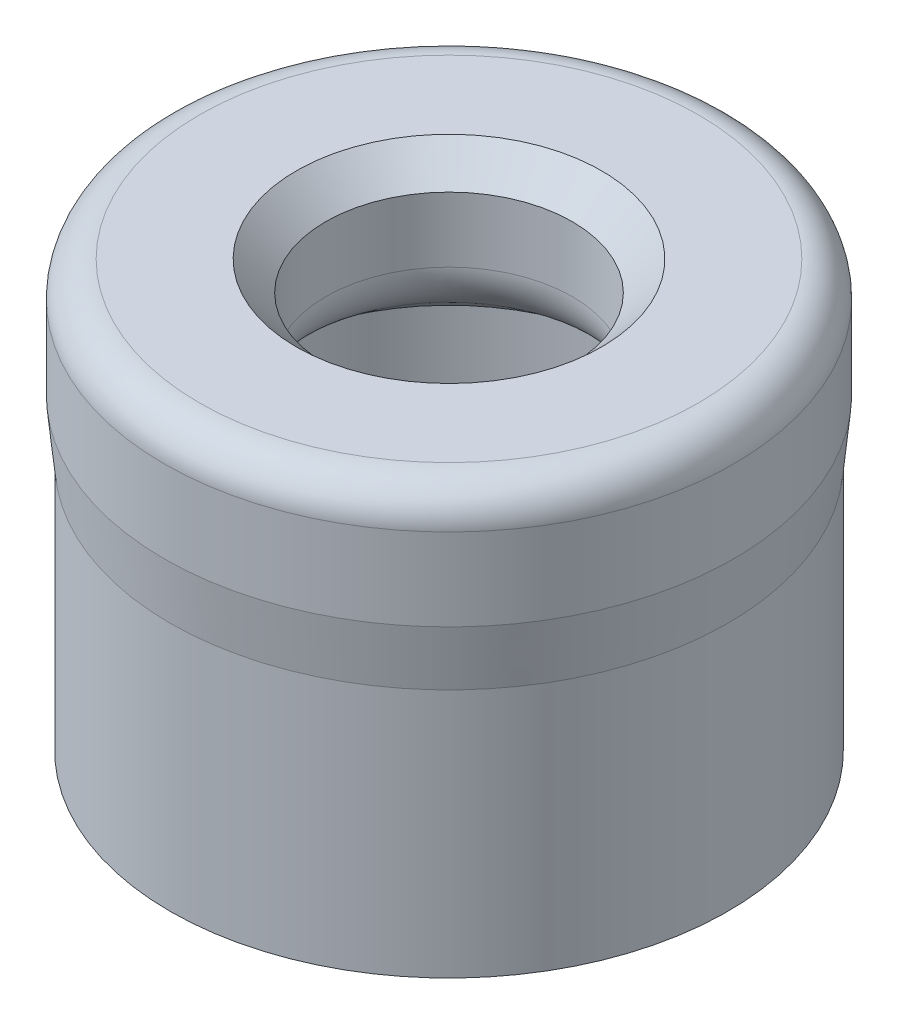
ISO-10303-21;
HEADER;
FILE_DESCRIPTION(('STEP AP214'),'2;1');
FILE_NAME('part.step','',(''),(''),'','','');
FILE_SCHEMA(('AUTOMOTIVE_DESIGN { 1 0 10303 214 1 1 1 1 }'));
ENDSEC;
DATA;
#1=APPLICATION_CONTEXT('core data for automotive mechanical design processes');
#2=APPLICATION_PROTOCOL_DEFINITION('international standard','automotive_design',2000,#1);
#3=PRODUCT_CONTEXT('',#1,'mechanical');
#4=PRODUCT('Part','Part','',(#3));
#5=PRODUCT_RELATED_PRODUCT_CATEGORY('part','',(#4));
#6=PRODUCT_DEFINITION_FORMATION('','',#4);
#7=PRODUCT_DEFINITION_CONTEXT('part definition',#1,'design');
#8=PRODUCT_DEFINITION('design','',#6,#7);
#9=PRODUCT_DEFINITION_SHAPE('','',#8);
#10=(LENGTH_UNIT() NAMED_UNIT(*) SI_UNIT(.MILLI.,.METRE.));
#11=(NAMED_UNIT(*) PLANE_ANGLE_UNIT() SI_UNIT($,.RADIAN.));
#12=(NAMED_UNIT(*) SI_UNIT($,.STERADIAN.) SOLID_ANGLE_UNIT());
#13=UNCERTAINTY_MEASURE_WITH_UNIT(LENGTH_MEASURE(1.E-05),#10,'distance_accuracy_value','');
#14=(GEOMETRIC_REPRESENTATION_CONTEXT(3) GLOBAL_UNCERTAINTY_ASSIGNED_CONTEXT((#13)) GLOBAL_UNIT_ASSIGNED_CONTEXT((#10,
#11,#12)) REPRESENTATION_CONTEXT('',''));
#15=CARTESIAN_POINT('',(0.,0.,0.));
#16=DIRECTION('',(0.,0.,1.));
#17=DIRECTION('',(1.,0.,0.));
#18=AXIS2_PLACEMENT_3D('',#15,#16,#17);
#19=CARTESIAN_POINT('',(0.,0.,0.));
#20=DIRECTION('',(0.,1.,0.));
#21=DIRECTION('',(0.,0.,1.));
#22=AXIS2_PLACEMENT_3D('',#19,#20,#21);
#23=PLANE('',#22);
#24=CARTESIAN_POINT('',(0.,0.,0.));
#25=DIRECTION('',(0.,1.,0.));
#26=DIRECTION('',(0.,0.,1.));
#27=AXIS2_PLACEMENT_3D('',#24,#25,#26);
#28=CIRCLE('',#27,3.975);
#29=CARTESIAN_POINT('',(0.,0.,3.975));
#30=VERTEX_POINT('',#29);
#31=EDGE_CURVE('E57',#30,#30,#28,.T.);
#32=ORIENTED_EDGE('',*,*,#31,.T.);
#33=EDGE_LOOP('',(#32));
#34=FACE_BOUND('',#33,.T.);
#35=CARTESIAN_POINT('',(0.,0.,0.));
#36=DIRECTION('',(0.,1.,0.));
#37=DIRECTION('',(0.,0.,1.));
#38=AXIS2_PLACEMENT_3D('',#35,#36,#37);
#39=CIRCLE('',#38,4.75);
#40=CARTESIAN_POINT('',(0.,0.,4.75));
#41=VERTEX_POINT('',#40);
#42=EDGE_CURVE('E78',#41,#41,#39,.T.);
#43=ORIENTED_EDGE('',*,*,#42,.F.);
#44=EDGE_LOOP('',(#43));
#45=FACE_BOUND('',#44,.T.);
#46=ADVANCED_FACE('F36',(#34,#45),#23,.F.);
#47=CARTESIAN_POINT('',(0.,4.25,0.));
#48=DIRECTION('',(0.,-1.,0.));
#49=DIRECTION('',(0.,0.,-1.));
#50=AXIS2_PLACEMENT_3D('',#47,#48,#49);
#51=CYLINDRICAL_SURFACE('',#50,4.75);
#52=CARTESIAN_POINT('',(0.,4.25,0.));
#53=DIRECTION('',(0.,1.,0.));
#54=DIRECTION('',(0.,0.,1.));
#55=AXIS2_PLACEMENT_3D('',#52,#53,#54);
#56=CIRCLE('',#55,4.75);
#57=CARTESIAN_POINT('',(0.,4.25,4.75));
#58=VERTEX_POINT('',#57);
#59=EDGE_CURVE('E77',#58,#58,#56,.T.);
#60=ORIENTED_EDGE('',*,*,#59,.F.);
#61=EDGE_LOOP('',(#60));
#62=FACE_BOUND('',#61,.T.);
#63=ORIENTED_EDGE('',*,*,#42,.T.);
#64=EDGE_LOOP('',(#63));
#65=FACE_BOUND('',#64,.T.);
#66=ADVANCED_FACE('F107',(#62,#65),#51,.T.);
#67=CARTESIAN_POINT('',(0.,4.25,0.));
#68=DIRECTION('',(0.,-1.,0.));
#69=DIRECTION('',(0.,0.,-1.));
#70=AXIS2_PLACEMENT_3D('',#67,#68,#69);
#71=CYLINDRICAL_SURFACE('',#70,3.275);
#72=CARTESIAN_POINT('',(0.,0.700000000000004,0.));
#73=DIRECTION('',(0.,1.,0.));
#74=DIRECTION('',(0.,0.,1.));
#75=AXIS2_PLACEMENT_3D('',#72,#73,#74);
#76=CIRCLE('',#75,3.275);
#77=CARTESIAN_POINT('',(0.,0.700000000000004,3.275));
#78=VERTEX_POINT('',#77);
#79=EDGE_CURVE('E51',#78,#78,#76,.F.);
#80=ORIENTED_EDGE('',*,*,#79,.T.);
#81=EDGE_LOOP('',(#80));
#82=FACE_BOUND('',#81,.T.);
#83=CARTESIAN_POINT('',(0.,4.25,0.));
#84=DIRECTION('',(0.,-1.,0.));
#85=DIRECTION('',(0.,0.,-1.));
#86=AXIS2_PLACEMENT_3D('',#83,#84,#85);
#87=CIRCLE('',#86,3.275);
#88=CARTESIAN_POINT('',(0.,4.25,-3.275));
#89=VERTEX_POINT('',#88);
#90=EDGE_CURVE('E82',#89,#89,#87,.T.);
#91=ORIENTED_EDGE('',*,*,#90,.F.);
#92=EDGE_LOOP('',(#91));
#93=FACE_BOUND('',#92,.T.);
#94=ADVANCED_FACE('F98',(#82,#93),#71,.F.);
#95=CARTESIAN_POINT('',(0.,5.25,0.));
#96=DIRECTION('',(0.,1.,0.));
#97=DIRECTION('',(0.,0.,1.));
#98=AXIS2_PLACEMENT_3D('',#95,#96,#97);
#99=CONICAL_SURFACE('',#98,4.85,0.0996686524911624);
#100=ORIENTED_EDGE('',*,*,#59,.T.);
#101=EDGE_LOOP('',(#100));
#102=FACE_BOUND('',#101,.T.);
#103=CARTESIAN_POINT('',(0.,5.25,0.));
#104=DIRECTION('',(0.,1.,0.));
#105=DIRECTION('',(0.,0.,1.));
#106=AXIS2_PLACEMENT_3D('',#103,#104,#105);
#107=CIRCLE('',#106,4.85);
#108=CARTESIAN_POINT('',(0.,5.25,4.85));
#109=VERTEX_POINT('',#108);
#110=EDGE_CURVE('E89',#109,#109,#107,.T.);
#111=ORIENTED_EDGE('',*,*,#110,.F.);
#112=EDGE_LOOP('',(#111));
#113=FACE_BOUND('',#112,.T.);
#114=ADVANCED_FACE('F95',(#102,#113),#99,.T.);
#115=CARTESIAN_POINT('',(0.,0.,0.));
#116=DIRECTION('',(0.,-1.,0.));
#117=DIRECTION('',(0.,0.,-1.));
#118=AXIS2_PLACEMENT_3D('',#115,#116,#117);
#119=CYLINDRICAL_SURFACE('',#118,2.1);
#120=CARTESIAN_POINT('',(0.,6.75,0.));
#121=DIRECTION('',(0.,1.,0.));
#122=DIRECTION('',(0.,0.,1.));
#123=AXIS2_PLACEMENT_3D('',#120,#121,#122);
#124=CIRCLE('',#123,2.1);
#125=CARTESIAN_POINT('',(0.,6.75,2.1));
#126=VERTEX_POINT('',#125);
#127=EDGE_CURVE('E44',#126,#126,#124,.T.);
#128=ORIENTED_EDGE('',*,*,#127,.T.);
#129=EDGE_LOOP('',(#128));
#130=FACE_BOUND('',#129,.T.);
#131=CARTESIAN_POINT('',(0.,5.64368171196729,0.));
#132=DIRECTION('',(0.,1.,0.));
#133=DIRECTION('',(0.,0.,1.));
#134=AXIS2_PLACEMENT_3D('',#131,#132,#133);
#135=CIRCLE('',#134,2.1);
#136=CARTESIAN_POINT('',(0.,5.64368171196729,2.1));
#137=VERTEX_POINT('',#136);
#138=EDGE_CURVE('E67',#137,#137,#135,.F.);
#139=ORIENTED_EDGE('',*,*,#138,.T.);
#140=EDGE_LOOP('',(#139));
#141=FACE_BOUND('',#140,.T.);
#142=ADVANCED_FACE('F97',(#130,#141),#119,.F.);
#143=CARTESIAN_POINT('',(0.,4.25,0.));
#144=DIRECTION('',(0.,-1.,0.));
#145=DIRECTION('',(0.,0.,-1.));
#146=AXIS2_PLACEMENT_3D('',#143,#144,#145);
#147=CONICAL_SURFACE('',#146,3.275,0.917160429875375);
#148=CARTESIAN_POINT('',(0.,4.84980356596565,0.));
#149=DIRECTION('',(0.,1.,0.));
#150=DIRECTION('',(0.,0.,1.));
#151=AXIS2_PLACEMENT_3D('',#148,#149,#150);
#152=CIRCLE('',#151,2.49192312221151);
#153=CARTESIAN_POINT('',(0.,4.84980356596565,2.49192312221151));
#154=VERTEX_POINT('',#153);
#155=EDGE_CURVE('E63',#154,#154,#152,.T.);
#156=ORIENTED_EDGE('',*,*,#155,.T.);
#157=EDGE_LOOP('',(#156));
#158=FACE_BOUND('',#157,.T.);
#159=ORIENTED_EDGE('',*,*,#90,.T.);
#160=EDGE_LOOP('',(#159));
#161=FACE_BOUND('',#160,.T.);
#162=ADVANCED_FACE('F105',(#158,#161),#147,.F.);
#163=CARTESIAN_POINT('',(0.,7.25,0.));
#164=DIRECTION('',(0.,1.,0.));
#165=DIRECTION('',(0.,0.,1.));
#166=AXIS2_PLACEMENT_3D('',#163,#164,#165);
#167=PLANE('',#166);
#168=CARTESIAN_POINT('',(0.,7.25,0.));
#169=DIRECTION('',(0.,1.,0.));
#170=DIRECTION('',(0.,0.,1.));
#171=AXIS2_PLACEMENT_3D('',#168,#169,#170);
#172=CIRCLE('',#171,2.6);
#173=CARTESIAN_POINT('',(0.,7.25,2.6));
#174=VERTEX_POINT('',#173);
#175=EDGE_CURVE('E10',#174,#174,#172,.F.);
#176=ORIENTED_EDGE('',*,*,#175,.T.);
#177=EDGE_LOOP('',(#176));
#178=FACE_BOUND('',#177,.T.);
#179=CARTESIAN_POINT('',(0.,7.25,0.));
#180=DIRECTION('',(0.,1.,0.));
#181=DIRECTION('',(0.,0.,1.));
#182=AXIS2_PLACEMENT_3D('',#179,#180,#181);
#183=CIRCLE('',#182,4.25);
#184=CARTESIAN_POINT('',(0.,7.25,4.25));
#185=VERTEX_POINT('',#184);
#186=EDGE_CURVE('E74',#185,#185,#183,.T.);
#187=ORIENTED_EDGE('',*,*,#186,.T.);
#188=EDGE_LOOP('',(#187));
#189=FACE_BOUND('',#188,.T.);
#190=ADVANCED_FACE('F141',(#178,#189),#167,.T.);
#191=CARTESIAN_POINT('',(0.,7.25,0.));
#192=DIRECTION('',(0.,-1.,0.));
#193=DIRECTION('',(0.,0.,-1.));
#194=AXIS2_PLACEMENT_3D('',#191,#192,#193);
#195=CYLINDRICAL_SURFACE('',#194,4.85);
#196=CARTESIAN_POINT('',(0.,6.65,0.));
#197=DIRECTION('',(0.,1.,0.));
#198=DIRECTION('',(0.,0.,1.));
#199=AXIS2_PLACEMENT_3D('',#196,#197,#198);
#200=CIRCLE('',#199,4.85);
#201=CARTESIAN_POINT('',(0.,6.65,4.85));
#202=VERTEX_POINT('',#201);
#203=EDGE_CURVE('E71',#202,#202,#200,.F.);
#204=ORIENTED_EDGE('',*,*,#203,.T.);
#205=EDGE_LOOP('',(#204));
#206=FACE_BOUND('',#205,.T.);
#207=ORIENTED_EDGE('',*,*,#110,.T.);
#208=EDGE_LOOP('',(#207));
#209=FACE_BOUND('',#208,.T.);
#210=ADVANCED_FACE('F93',(#206,#209),#195,.T.);
#211=CARTESIAN_POINT('',(0.,6.65,0.));
#212=DIRECTION('',(0.,1.,0.));
#213=DIRECTION('',(0.,0.,1.));
#214=AXIS2_PLACEMENT_3D('',#211,#212,#213);
#215=TOROIDAL_SURFACE('',#214,4.25,0.6);
#216=ORIENTED_EDGE('',*,*,#203,.F.);
#217=EDGE_LOOP('',(#216));
#218=FACE_BOUND('',#217,.T.);
#219=ORIENTED_EDGE('',*,*,#186,.F.);
#220=EDGE_LOOP('',(#219));
#221=FACE_BOUND('',#220,.T.);
#222=ADVANCED_FACE('F120',(#218,#221),#215,.T.);
#223=CARTESIAN_POINT('',(0.,5.64368171196729,0.));
#224=DIRECTION('',(0.,1.,0.));
#225=DIRECTION('',(0.,0.,1.));
#226=AXIS2_PLACEMENT_3D('',#223,#224,#225);
#227=TOROIDAL_SURFACE('',#226,3.1,1.);
#228=ORIENTED_EDGE('',*,*,#155,.F.);
#229=EDGE_LOOP('',(#228));
#230=FACE_BOUND('',#229,.T.);
#231=ORIENTED_EDGE('',*,*,#138,.F.);
#232=EDGE_LOOP('',(#231));
#233=FACE_BOUND('',#232,.T.);
#234=ADVANCED_FACE('F123',(#230,#233),#227,.T.);
#235=CARTESIAN_POINT('',(0.,0.,0.));
#236=DIRECTION('',(0.,-1.,0.));
#237=DIRECTION('',(0.,0.,-1.));
#238=AXIS2_PLACEMENT_3D('',#235,#236,#237);
#239=CONICAL_SURFACE('',#238,3.975,0.785398163397447);
#240=ORIENTED_EDGE('',*,*,#79,.F.);
#241=EDGE_LOOP('',(#240));
#242=FACE_BOUND('',#241,.T.);
#243=ORIENTED_EDGE('',*,*,#31,.F.);
#244=EDGE_LOOP('',(#243));
#245=FACE_BOUND('',#244,.T.);
#246=ADVANCED_FACE('F126',(#242,#245),#239,.F.);
#247=CARTESIAN_POINT('',(0.,6.75,0.));
#248=DIRECTION('',(0.,1.,0.));
#249=DIRECTION('',(0.,0.,1.));
#250=AXIS2_PLACEMENT_3D('',#247,#248,#249);
#251=CONICAL_SURFACE('',#250,2.1,0.785398163397449);
#252=ORIENTED_EDGE('',*,*,#175,.F.);
#253=EDGE_LOOP('',(#252));
#254=FACE_BOUND('',#253,.T.);
#255=ORIENTED_EDGE('',*,*,#127,.F.);
#256=EDGE_LOOP('',(#255));
#257=FACE_BOUND('',#256,.T.);
#258=ADVANCED_FACE('F38',(#254,#257),#251,.F.);
#259=CLOSED_SHELL('',(#46,#66,#94,#114,#142,#162,#190,#210,#222,#234,#246,#258));
#260=MANIFOLD_SOLID_BREP('B2',#259);
#261=ADVANCED_BREP_SHAPE_REPRESENTATION('',(#18,#260),#14);
#262=SHAPE_DEFINITION_REPRESENTATION(#9,#261);
ENDSEC;
END-ISO-10303-21;
